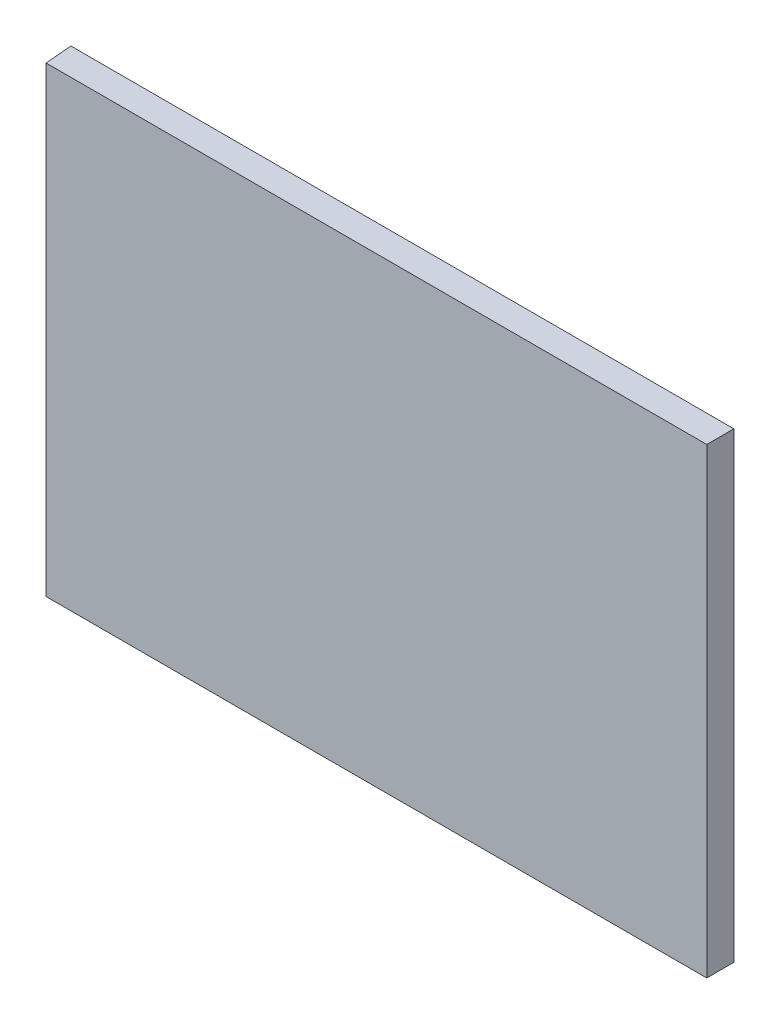
ISO-10303-21;
HEADER;
FILE_DESCRIPTION(('STEP AP214'),'2;1');
FILE_NAME('part.step','',(''),(''),'','','');
FILE_SCHEMA(('AUTOMOTIVE_DESIGN { 1 0 10303 214 1 1 1 1 }'));
ENDSEC;
DATA;
#1=APPLICATION_CONTEXT('core data for automotive mechanical design processes');
#2=APPLICATION_PROTOCOL_DEFINITION('international standard','automotive_design',2000,#1);
#3=PRODUCT_CONTEXT('',#1,'mechanical');
#4=PRODUCT('Part','Part','',(#3));
#5=PRODUCT_RELATED_PRODUCT_CATEGORY('part','',(#4));
#6=PRODUCT_DEFINITION_FORMATION('','',#4);
#7=PRODUCT_DEFINITION_CONTEXT('part definition',#1,'design');
#8=PRODUCT_DEFINITION('design','',#6,#7);
#9=PRODUCT_DEFINITION_SHAPE('','',#8);
#10=(LENGTH_UNIT() NAMED_UNIT(*) SI_UNIT(.MILLI.,.METRE.));
#11=(NAMED_UNIT(*) PLANE_ANGLE_UNIT() SI_UNIT($,.RADIAN.));
#12=(NAMED_UNIT(*) SI_UNIT($,.STERADIAN.) SOLID_ANGLE_UNIT());
#13=UNCERTAINTY_MEASURE_WITH_UNIT(LENGTH_MEASURE(1.E-05),#10,'distance_accuracy_value','');
#14=(GEOMETRIC_REPRESENTATION_CONTEXT(3) GLOBAL_UNCERTAINTY_ASSIGNED_CONTEXT((#13)) GLOBAL_UNIT_ASSIGNED_CONTEXT((#10,
#11,#12)) REPRESENTATION_CONTEXT('',''));
#15=CARTESIAN_POINT('',(0.,0.,0.));
#16=DIRECTION('',(0.,0.,1.));
#17=DIRECTION('',(1.,0.,0.));
#18=AXIS2_PLACEMENT_3D('',#15,#16,#17);
#19=CARTESIAN_POINT('',(0.,0.,1.));
#20=DIRECTION('',(0.,0.,1.));
#21=DIRECTION('',(1.,0.,0.));
#22=AXIS2_PLACEMENT_3D('',#19,#20,#21);
#23=PLANE('',#22);
#24=DIRECTION('',(-1.,0.,0.));
#25=VECTOR('',#24,1.);
#26=CARTESIAN_POINT('',(13.4118723306581,-10.04,1.));
#27=LINE('',#26,#25);
#28=CARTESIAN_POINT('',(13.4118723306581,-10.04,1.));
#29=VERTEX_POINT('',#28);
#30=CARTESIAN_POINT('',(-10.950639005816,-10.04,1.));
#31=VERTEX_POINT('',#30);
#32=EDGE_CURVE('E94',#29,#31,#27,.T.);
#33=ORIENTED_EDGE('',*,*,#32,.F.);
#34=DIRECTION('',(0.,-1.,0.));
#35=VECTOR('',#34,1.);
#36=CARTESIAN_POINT('',(13.4118723306581,7.,1.));
#37=LINE('',#36,#35);
#38=CARTESIAN_POINT('',(13.4118723306581,7.,1.));
#39=VERTEX_POINT('',#38);
#40=EDGE_CURVE('E101',#39,#29,#37,.T.);
#41=ORIENTED_EDGE('',*,*,#40,.F.);
#42=DIRECTION('',(1.,0.,0.));
#43=VECTOR('',#42,1.);
#44=CARTESIAN_POINT('',(-10.950639005816,7.,1.));
#45=LINE('',#44,#43);
#46=CARTESIAN_POINT('',(-10.950639005816,7.,1.));
#47=VERTEX_POINT('',#46);
#48=EDGE_CURVE('E90',#47,#39,#45,.T.);
#49=ORIENTED_EDGE('',*,*,#48,.F.);
#50=DIRECTION('',(0.,1.,0.));
#51=VECTOR('',#50,1.);
#52=CARTESIAN_POINT('',(-10.950639005816,-12.04,1.));
#53=LINE('',#52,#51);
#54=EDGE_CURVE('E52',#31,#47,#53,.T.);
#55=ORIENTED_EDGE('',*,*,#54,.F.);
#56=EDGE_LOOP('',(#33,#41,#49,#55));
#57=FACE_BOUND('',#56,.T.);
#58=ADVANCED_FACE('F44',(#57),#23,.T.);
#59=CARTESIAN_POINT('',(0.,0.,0.));
#60=DIRECTION('',(0.,0.,1.));
#61=DIRECTION('',(1.,0.,0.));
#62=AXIS2_PLACEMENT_3D('',#59,#60,#61);
#63=PLANE('',#62);
#64=DIRECTION('',(0.,-1.,0.));
#65=VECTOR('',#64,1.);
#66=CARTESIAN_POINT('',(-11.0381276693419,9.,0.));
#67=LINE('',#66,#65);
#68=CARTESIAN_POINT('',(-11.0381276693419,7.,0.));
#69=VERTEX_POINT('',#68);
#70=CARTESIAN_POINT('',(-11.0381276693419,-10.04,0.));
#71=VERTEX_POINT('',#70);
#72=EDGE_CURVE('E11',#69,#71,#67,.T.);
#73=ORIENTED_EDGE('',*,*,#72,.F.);
#74=DIRECTION('',(-1.,0.,0.));
#75=VECTOR('',#74,1.);
#76=CARTESIAN_POINT('',(-10.950639005816,7.,0.));
#77=LINE('',#76,#75);
#78=CARTESIAN_POINT('',(13.4118723306581,7.,0.));
#79=VERTEX_POINT('',#78);
#80=EDGE_CURVE('E105',#79,#69,#77,.T.);
#81=ORIENTED_EDGE('',*,*,#80,.F.);
#82=DIRECTION('',(0.,1.,0.));
#83=VECTOR('',#82,1.);
#84=CARTESIAN_POINT('',(13.4118723306581,7.,0.));
#85=LINE('',#84,#83);
#86=CARTESIAN_POINT('',(13.4118723306581,-10.04,0.));
#87=VERTEX_POINT('',#86);
#88=EDGE_CURVE('E66',#87,#79,#85,.T.);
#89=ORIENTED_EDGE('',*,*,#88,.F.);
#90=DIRECTION('',(1.,0.,0.));
#91=VECTOR('',#90,1.);
#92=CARTESIAN_POINT('',(13.4118723306581,-10.04,0.));
#93=LINE('',#92,#91);
#94=EDGE_CURVE('E59',#71,#87,#93,.T.);
#95=ORIENTED_EDGE('',*,*,#94,.F.);
#96=EDGE_LOOP('',(#73,#81,#89,#95));
#97=FACE_BOUND('',#96,.T.);
#98=ADVANCED_FACE('F46',(#97),#63,.F.);
#99=CARTESIAN_POINT('',(-10.950639005816,-12.04,1.));
#100=DIRECTION('',(0.996194698091746,0.,-0.0871557427476526));
#101=DIRECTION('',(-0.0871557427476526,0.,-0.996194698091746));
#102=AXIS2_PLACEMENT_3D('',#99,#100,#101);
#103=PLANE('',#102);
#104=ORIENTED_EDGE('',*,*,#54,.T.);
#105=DIRECTION('',(-0.0871557427476526,0.,-0.996194698091746));
#106=VECTOR('',#105,1.);
#107=CARTESIAN_POINT('',(-10.950639005816,7.,1.));
#108=LINE('',#107,#106);
#109=EDGE_CURVE('E91',#47,#69,#108,.T.);
#110=ORIENTED_EDGE('',*,*,#109,.T.);
#111=ORIENTED_EDGE('',*,*,#72,.T.);
#112=DIRECTION('',(0.0871557427476526,0.,0.996194698091746));
#113=VECTOR('',#112,1.);
#114=CARTESIAN_POINT('',(-10.950639005816,-10.04,1.));
#115=LINE('',#114,#113);
#116=EDGE_CURVE('E84',#71,#31,#115,.T.);
#117=ORIENTED_EDGE('',*,*,#116,.T.);
#118=EDGE_LOOP('',(#104,#110,#111,#117));
#119=FACE_BOUND('',#118,.T.);
#120=ADVANCED_FACE('F86',(#119),#103,.F.);
#121=CARTESIAN_POINT('',(13.4118723306581,-10.04,-33.3399324028896));
#122=DIRECTION('',(0.,1.,0.));
#123=DIRECTION('',(-1.,0.,0.));
#124=AXIS2_PLACEMENT_3D('',#121,#122,#123);
#125=PLANE('',#124);
#126=ORIENTED_EDGE('',*,*,#94,.T.);
#127=DIRECTION('',(0.,0.,1.));
#128=VECTOR('',#127,1.);
#129=CARTESIAN_POINT('',(13.4118723306581,-10.04,-33.3399324028896));
#130=LINE('',#129,#128);
#131=EDGE_CURVE('E96',#87,#29,#130,.T.);
#132=ORIENTED_EDGE('',*,*,#131,.T.);
#133=ORIENTED_EDGE('',*,*,#32,.T.);
#134=ORIENTED_EDGE('',*,*,#116,.F.);
#135=EDGE_LOOP('',(#126,#132,#133,#134));
#136=FACE_BOUND('',#135,.T.);
#137=ADVANCED_FACE('F95',(#136),#125,.F.);
#138=CARTESIAN_POINT('',(13.4118723306581,7.,-33.3399324028896));
#139=DIRECTION('',(-1.,0.,0.));
#140=DIRECTION('',(0.,0.,1.));
#141=AXIS2_PLACEMENT_3D('',#138,#139,#140);
#142=PLANE('',#141);
#143=ORIENTED_EDGE('',*,*,#88,.T.);
#144=DIRECTION('',(0.,0.,1.));
#145=VECTOR('',#144,1.);
#146=CARTESIAN_POINT('',(13.4118723306581,7.,-33.3399324028896));
#147=LINE('',#146,#145);
#148=EDGE_CURVE('E100',#79,#39,#147,.T.);
#149=ORIENTED_EDGE('',*,*,#148,.T.);
#150=ORIENTED_EDGE('',*,*,#40,.T.);
#151=ORIENTED_EDGE('',*,*,#131,.F.);
#152=EDGE_LOOP('',(#143,#149,#150,#151));
#153=FACE_BOUND('',#152,.T.);
#154=ADVANCED_FACE('F118',(#153),#142,.F.);
#155=CARTESIAN_POINT('',(-10.950639005816,7.,-33.3399324028896));
#156=DIRECTION('',(0.,-1.,0.));
#157=DIRECTION('',(0.,0.,-1.));
#158=AXIS2_PLACEMENT_3D('',#155,#156,#157);
#159=PLANE('',#158);
#160=ORIENTED_EDGE('',*,*,#80,.T.);
#161=ORIENTED_EDGE('',*,*,#109,.F.);
#162=ORIENTED_EDGE('',*,*,#48,.T.);
#163=ORIENTED_EDGE('',*,*,#148,.F.);
#164=EDGE_LOOP('',(#160,#161,#162,#163));
#165=FACE_BOUND('',#164,.T.);
#166=ADVANCED_FACE('F117',(#165),#159,.F.);
#167=CLOSED_SHELL('',(#58,#98,#120,#137,#154,#166));
#168=MANIFOLD_SOLID_BREP('B2',#167);
#169=ADVANCED_BREP_SHAPE_REPRESENTATION('',(#18,#168),#14);
#170=SHAPE_DEFINITION_REPRESENTATION(#9,#169);
ENDSEC;
END-ISO-10303-21;
